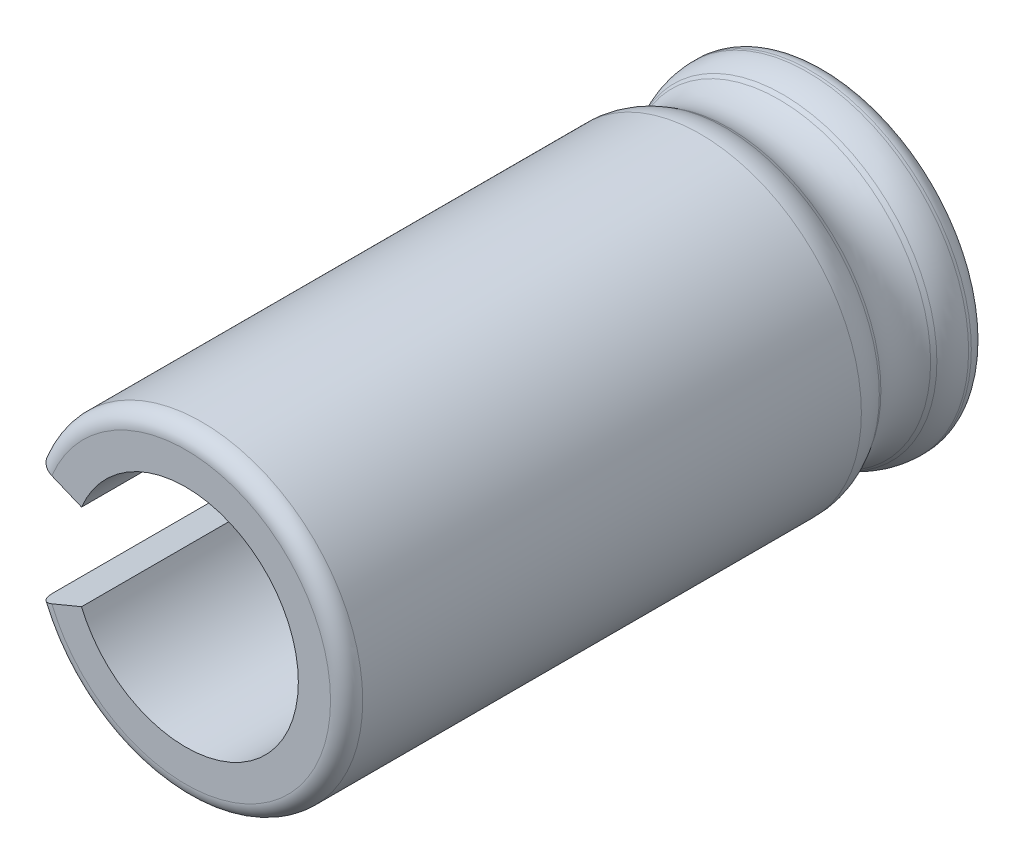
ISO-10303-21;
HEADER;
FILE_DESCRIPTION(('STEP AP214'),'2;1');
FILE_NAME('part.step','',(''),(''),'','','');
FILE_SCHEMA(('AUTOMOTIVE_DESIGN { 1 0 10303 214 1 1 1 1 }'));
ENDSEC;
DATA;
#1=APPLICATION_CONTEXT('core data for automotive mechanical design processes');
#2=APPLICATION_PROTOCOL_DEFINITION('international standard','automotive_design',2000,#1);
#3=PRODUCT_CONTEXT('',#1,'mechanical');
#4=PRODUCT('Part','Part','',(#3));
#5=PRODUCT_RELATED_PRODUCT_CATEGORY('part','',(#4));
#6=PRODUCT_DEFINITION_FORMATION('','',#4);
#7=PRODUCT_DEFINITION_CONTEXT('part definition',#1,'design');
#8=PRODUCT_DEFINITION('design','',#6,#7);
#9=PRODUCT_DEFINITION_SHAPE('','',#8);
#10=(LENGTH_UNIT() NAMED_UNIT(*) SI_UNIT(.MILLI.,.METRE.));
#11=(NAMED_UNIT(*) PLANE_ANGLE_UNIT() SI_UNIT($,.RADIAN.));
#12=(NAMED_UNIT(*) SI_UNIT($,.STERADIAN.) SOLID_ANGLE_UNIT());
#13=UNCERTAINTY_MEASURE_WITH_UNIT(LENGTH_MEASURE(1.E-05),#10,'distance_accuracy_value','');
#14=(GEOMETRIC_REPRESENTATION_CONTEXT(3) GLOBAL_UNCERTAINTY_ASSIGNED_CONTEXT((#13)) GLOBAL_UNIT_ASSIGNED_CONTEXT((#10,
#11,#12)) REPRESENTATION_CONTEXT('',''));
#15=CARTESIAN_POINT('',(0.,0.,0.));
#16=DIRECTION('',(0.,0.,1.));
#17=DIRECTION('',(1.,0.,0.));
#18=AXIS2_PLACEMENT_3D('',#15,#16,#17);
#19=CARTESIAN_POINT('',(0.,0.,0.66));
#20=DIRECTION('',(0.,0.,1.));
#21=DIRECTION('',(1.,0.,0.));
#22=AXIS2_PLACEMENT_3D('',#19,#20,#21);
#23=CYLINDRICAL_SURFACE('',#22,8.25);
#24=DIRECTION('',(0.,0.,1.));
#25=VECTOR('',#24,1.);
#26=CARTESIAN_POINT('',(-7.62200614321812,-3.15713831701198,0.66));
#27=LINE('',#26,#25);
#28=CARTESIAN_POINT('',(-7.62200614321812,-3.15713831701198,1.62446468675263));
#29=VERTEX_POINT('',#28);
#30=CARTESIAN_POINT('',(-7.62200614321812,-3.15713831701198,1.485));
#31=VERTEX_POINT('',#30);
#32=EDGE_CURVE('E102',#29,#31,#27,.F.);
#33=ORIENTED_EDGE('',*,*,#32,.T.);
#34=CARTESIAN_POINT('',(0.,0.,1.485));
#35=DIRECTION('',(0.,0.,1.));
#36=DIRECTION('',(1.,0.,0.));
#37=AXIS2_PLACEMENT_3D('',#34,#35,#36);
#38=CIRCLE('',#37,8.25);
#39=CARTESIAN_POINT('',(-7.62200614321812,3.15713831701198,1.485));
#40=VERTEX_POINT('',#39);
#41=EDGE_CURVE('E118',#40,#31,#38,.F.);
#42=ORIENTED_EDGE('',*,*,#41,.F.);
#43=DIRECTION('',(0.,0.,1.));
#44=VECTOR('',#43,1.);
#45=CARTESIAN_POINT('',(-7.62200614321812,3.15713831701198,0.66));
#46=LINE('',#45,#44);
#47=CARTESIAN_POINT('',(-7.62200614321812,3.15713831701198,1.62446468675263));
#48=VERTEX_POINT('',#47);
#49=EDGE_CURVE('E108',#40,#48,#46,.T.);
#50=ORIENTED_EDGE('',*,*,#49,.T.);
#51=CARTESIAN_POINT('',(0.,0.,1.62446468675263));
#52=DIRECTION('',(0.,0.,-1.));
#53=DIRECTION('',(1.,0.,0.));
#54=AXIS2_PLACEMENT_3D('',#51,#52,#53);
#55=CIRCLE('',#54,8.25);
#56=EDGE_CURVE('E159',#29,#48,#55,.F.);
#57=ORIENTED_EDGE('',*,*,#56,.F.);
#58=EDGE_LOOP('',(#33,#42,#50,#57));
#59=FACE_BOUND('',#58,.T.);
#60=ADVANCED_FACE('F17',(#59),#23,.T.);
#61=CARTESIAN_POINT('',(0.,0.,1.485));
#62=DIRECTION('',(0.,0.,1.));
#63=DIRECTION('',(1.,0.,0.));
#64=AXIS2_PLACEMENT_3D('',#61,#62,#63);
#65=TOROIDAL_SURFACE('',#64,7.425,0.825);
#66=CARTESIAN_POINT('',(-7.62200614321812,-3.15713831701198,1.485));
#67=CARTESIAN_POINT('',(-7.62204256182288,-3.15715340209199,1.4385869007782));
#68=CARTESIAN_POINT('',(-7.61838977789418,-3.15564036944831,1.39218557898556));
#69=CARTESIAN_POINT('',(-7.60397454988172,-3.14966938650084,1.30073102324611));
#70=CARTESIAN_POINT('',(-7.59321768404102,-3.145213746781,1.25567676055645));
#71=CARTESIAN_POINT('',(-7.5648554521704,-3.13346572568102,1.1681429880569));
#72=CARTESIAN_POINT('',(-7.54724679770689,-3.12617198218709,1.12566472589937));
#73=CARTESIAN_POINT('',(-7.50569620354201,-3.10896116255934,1.04451771986299));
#74=CARTESIAN_POINT('',(-7.4817553795292,-3.09904454855885,1.00584830653449));
#75=CARTESIAN_POINT('',(-7.42821320353762,-3.07686665310416,0.933405071623153));
#76=CARTESIAN_POINT('',(-7.39861130772004,-3.06460514638457,0.899631720935907));
#77=CARTESIAN_POINT('',(-7.33458880166737,-3.03808615608044,0.837943980824093));
#78=CARTESIAN_POINT('',(-7.30016826911911,-3.02382870467484,0.810029496960073));
#79=CARTESIAN_POINT('',(-7.22747906633709,-2.99371985104444,0.760844503551425));
#80=CARTESIAN_POINT('',(-7.18920923901439,-2.97786796953771,0.739575999710074));
#81=CARTESIAN_POINT('',(-7.10992142407507,-2.94502588125891,0.704306217909734));
#82=CARTESIAN_POINT('',(-7.06890506199236,-2.92803634780505,0.69030068355104));
#83=CARTESIAN_POINT('',(-6.99966567094381,-2.89935645298228,0.673435012043788));
#84=CARTESIAN_POINT('',(-6.97187820912626,-2.88784650943353,0.668399926773944));
#85=CARTESIAN_POINT('',(-6.91599955724884,-2.86470081397878,0.66168286404564));
#86=CARTESIAN_POINT('',(-6.88790885478471,-2.85306526404155,0.659996132962406));
#87=CARTESIAN_POINT('',(-6.85980552889632,-2.84142448531079,0.66));
#88=B_SPLINE_CURVE_WITH_KNOTS('',3,(#66,#67,#68,#69,#70,#71,#72,#73,#74,#75,#76,#77,#78,#79,#80,
#81,#82,#83,#84,#85,#86,#87),.UNSPECIFIED.,.F.,.F.,(4,2,2,2,2,2,2,2,2,2,4),(0.,
0.139054322565421,0.277999586981286,0.417011618920025,0.555999174107767,0.695000088043242,
0.833998761241885,0.973039342697627,1.11199834829052,1.20331120693813,1.29449433666177),.UNSPECIFIED.);
#89=CARTESIAN_POINT('',(-6.85980552889631,-2.84142448531078,0.66));
#90=VERTEX_POINT('',#89);
#91=EDGE_CURVE('E121',#31,#90,#88,.T.);
#92=ORIENTED_EDGE('',*,*,#91,.T.);
#93=CARTESIAN_POINT('',(0.,0.,0.66));
#94=DIRECTION('',(0.,0.,1.));
#95=DIRECTION('',(-0.923879532511287,-0.382683432365088,0.));
#96=AXIS2_PLACEMENT_3D('',#93,#94,#95);
#97=CIRCLE('',#96,7.425);
#98=CARTESIAN_POINT('',(-6.85980552889631,2.84142448531078,0.66));
#99=VERTEX_POINT('',#98);
#100=EDGE_CURVE('E125',#90,#99,#97,.T.);
#101=ORIENTED_EDGE('',*,*,#100,.T.);
#102=CARTESIAN_POINT('',(-6.85980552889631,2.84142448531078,0.66));
#103=CARTESIAN_POINT('',(-6.90268564130775,2.85918600942769,0.659960580786261));
#104=CARTESIAN_POINT('',(-6.94555487279344,2.87694302651757,0.663914325620036));
#105=CARTESIAN_POINT('',(-7.03004786499603,2.91194116981336,0.67951725598617));
#106=CARTESIAN_POINT('',(-7.07167257614739,2.92918268970212,0.691160403671727));
#107=CARTESIAN_POINT('',(-7.15254323696322,2.96268041421011,0.72185946223138));
#108=CARTESIAN_POINT('',(-7.19178803394722,2.97893614137346,0.740918932480317));
#109=CARTESIAN_POINT('',(-7.26675809194879,3.00998975616961,0.785892971521898));
#110=CARTESIAN_POINT('',(-7.30248397145722,3.02478789998971,0.811806332701936));
#111=CARTESIAN_POINT('',(-7.36941279346071,3.05251072577721,0.86975996638191));
#112=CARTESIAN_POINT('',(-7.40061530090498,3.06543522754067,0.901800827528727));
#113=CARTESIAN_POINT('',(-7.45760734140116,3.08904210366151,0.971098288723308));
#114=CARTESIAN_POINT('',(-7.48339696170375,3.09972451415929,1.00835480468346));
#115=CARTESIAN_POINT('',(-7.5288379704207,3.11854679625776,1.08703303082019));
#116=CARTESIAN_POINT('',(-7.54848750580686,3.12668590030905,1.12845599342081));
#117=CARTESIAN_POINT('',(-7.58107253532833,3.14018306146717,1.21427650588936));
#118=CARTESIAN_POINT('',(-7.59401196186422,3.14554274742766,1.25867229629206));
#119=CARTESIAN_POINT('',(-7.60959381057183,3.15199696048919,1.333616473116));
#120=CARTESIAN_POINT('',(-7.61424562279708,3.15392380420251,1.36369340505324));
#121=CARTESIAN_POINT('',(-7.62045137957036,3.15649431282279,1.42417602200821));
#122=CARTESIAN_POINT('',(-7.62200971589501,3.1571397968632,1.45458117925612));
#123=CARTESIAN_POINT('',(-7.62200614321812,3.15713831701198,1.48499999999999));
#124=B_SPLINE_CURVE_WITH_KNOTS('',3,(#102,#103,#104,#105,#106,#107,#108,#109,#110,#111,#112,
#113,#114,#115,#116,#117,#118,#119,#120,#121,#122,#123),.UNSPECIFIED.,.F.,.F.,(4,2,2,2,2,2,2,2,
2,2,4),(0.,0.139054322565421,0.277999586981286,0.417011618920024,0.555999174107765,
0.695000088043241,0.833998761241884,0.973039342697627,1.11199834829052,1.20331120693813,
1.29449433666177),.UNSPECIFIED.);
#125=EDGE_CURVE('E111',#99,#40,#124,.T.);
#126=ORIENTED_EDGE('',*,*,#125,.T.);
#127=ORIENTED_EDGE('',*,*,#41,.T.);
#128=EDGE_LOOP('',(#92,#101,#126,#127));
#129=FACE_BOUND('',#128,.T.);
#130=ADVANCED_FACE('F123',(#129),#65,.T.);
#131=CARTESIAN_POINT('',(0.,0.,1.62446468675263));
#132=DIRECTION('',(0.,0.,-1.));
#133=DIRECTION('',(1.,0.,0.));
#134=AXIS2_PLACEMENT_3D('',#131,#132,#133);
#135=TOROIDAL_SURFACE('',#134,5.775,2.475);
#136=CARTESIAN_POINT('',(-7.29614920451681,-3.02216395360852,2.89784168143576));
#137=CARTESIAN_POINT('',(-7.32959862613637,-3.03601915769687,2.83751440338843));
#138=CARTESIAN_POINT('',(-7.36065887081203,-3.04888473229216,2.7756364129829));
#139=CARTESIAN_POINT('',(-7.417810131177,-3.07255755944205,2.64922920039002));
#140=CARTESIAN_POINT('',(-7.44389994826096,-3.08336431551806,2.58469934326148));
#141=CARTESIAN_POINT('',(-7.49038153195387,-3.10261761788424,2.45492450615544));
#142=CARTESIAN_POINT('',(-7.51088691933286,-3.11111122743833,2.38972719072762));
#143=CARTESIAN_POINT('',(-7.5468028239492,-3.12598808223532,2.25773743006298));
#144=CARTESIAN_POINT('',(-7.56221518008407,-3.1323720891745,2.19094556991512));
#145=CARTESIAN_POINT('',(-7.59052595214416,-3.14409879492304,2.04209633392546));
#146=CARTESIAN_POINT('',(-7.60222399703514,-3.14894428377014,1.9597684469408));
#147=CARTESIAN_POINT('',(-7.61802539438933,-3.15548943685869,1.79312126799482));
#148=CARTESIAN_POINT('',(-7.62202236655024,-3.15714503693617,1.7087901505208));
#149=CARTESIAN_POINT('',(-7.62200614321812,-3.15713831701198,1.62446468675264));
#150=B_SPLINE_CURVE_WITH_KNOTS('',3,(#136,#137,#138,#139,#140,#141,#142,#143,#144,#145,#146,
#147,#148,#149),.UNSPECIFIED.,.F.,.F.,(4,2,2,2,2,2,4),(0.,0.211008075584621,0.422066970973275,
0.628441188520761,0.834740810658238,1.08419689867841,1.33707486560758),.UNSPECIFIED.);
#151=CARTESIAN_POINT('',(-7.29614920451681,-3.02216395360852,2.89784168143576));
#152=VERTEX_POINT('',#151);
#153=EDGE_CURVE('E166',#152,#29,#150,.T.);
#154=ORIENTED_EDGE('',*,*,#153,.T.);
#155=ORIENTED_EDGE('',*,*,#56,.T.);
#156=CARTESIAN_POINT('',(-7.62200614321812,3.15713831701198,1.62446468675263));
#157=CARTESIAN_POINT('',(-7.622013293985,3.1571412789566,1.69482242196139));
#158=CARTESIAN_POINT('',(-7.61923463906558,3.15599032240382,1.765179382395));
#159=CARTESIAN_POINT('',(-7.60815603495956,3.15140141433095,1.90539942074843));
#160=CARTESIAN_POINT('',(-7.59985475616942,3.14796291207103,1.97526237563904));
#161=CARTESIAN_POINT('',(-7.57802623977233,3.13892124453288,2.11242833256909));
#162=CARTESIAN_POINT('',(-7.56461908766232,3.13336782029611,2.17975373643241));
#163=CARTESIAN_POINT('',(-7.5326777519397,3.12013728583949,2.3129350938501));
#164=CARTESIAN_POINT('',(-7.51414542328028,3.1124609439664,2.37879156975146));
#165=CARTESIAN_POINT('',(-7.46766889041409,3.09320973372115,2.52219461467689));
#166=CARTESIAN_POINT('',(-7.43856679390817,3.0811552506549,2.59930467503715));
#167=CARTESIAN_POINT('',(-7.37290362716102,3.05395667643987,2.75100303208612));
#168=CARTESIAN_POINT('',(-7.33624571551737,3.03877247226879,2.82554222734678));
#169=CARTESIAN_POINT('',(-7.29614920451682,3.02216395360852,2.89784168143575));
#170=B_SPLINE_CURVE_WITH_KNOTS('',3,(#156,#157,#158,#159,#160,#161,#162,#163,#164,#165,#166,
#167,#168,#169),.UNSPECIFIED.,.F.,.F.,(4,2,2,2,2,2,4),(0.,0.211008075584621,0.422066970973275,
0.628441188520762,0.834740810658239,1.08419689867841,1.33707486560757),.UNSPECIFIED.);
#171=CARTESIAN_POINT('',(-7.29614920451681,3.02216395360852,2.89784168143576));
#172=VERTEX_POINT('',#171);
#173=EDGE_CURVE('E114',#48,#172,#170,.T.);
#174=ORIENTED_EDGE('',*,*,#173,.T.);
#175=CARTESIAN_POINT('',(0.,0.,2.89784168143576));
#176=DIRECTION('',(0.,0.,-1.));
#177=DIRECTION('',(-1.,0.,0.));
#178=AXIS2_PLACEMENT_3D('',#175,#176,#177);
#179=CIRCLE('',#178,7.89729499113855);
#180=EDGE_CURVE('E155',#152,#172,#179,.F.);
#181=ORIENTED_EDGE('',*,*,#180,.F.);
#182=EDGE_LOOP('',(#154,#155,#174,#181));
#183=FACE_BOUND('',#182,.T.);
#184=ADVANCED_FACE('F146',(#183),#135,.T.);
#185=CARTESIAN_POINT('',(0.,0.,0.66));
#186=DIRECTION('',(0.,0.,1.));
#187=DIRECTION('',(1.,0.,0.));
#188=AXIS2_PLACEMENT_3D('',#185,#186,#187);
#189=PLANE('',#188);
#190=ORIENTED_EDGE('',*,*,#100,.F.);
#191=DIRECTION('',(-0.923879532511287,-0.382683432365089,0.));
#192=VECTOR('',#191,1.);
#193=CARTESIAN_POINT('',(-5.33540430025268,-2.20999682190838,0.66));
#194=LINE('',#193,#192);
#195=CARTESIAN_POINT('',(-5.33540430025268,-2.20999682190838,0.66));
#196=VERTEX_POINT('',#195);
#197=EDGE_CURVE('E165',#196,#90,#194,.T.);
#198=ORIENTED_EDGE('',*,*,#197,.F.);
#199=CARTESIAN_POINT('',(0.,0.,0.66));
#200=DIRECTION('',(0.,0.,1.));
#201=DIRECTION('',(1.,0.,0.));
#202=AXIS2_PLACEMENT_3D('',#199,#200,#201);
#203=CIRCLE('',#202,5.775);
#204=CARTESIAN_POINT('',(-5.33540430025269,2.20999682190838,0.66));
#205=VERTEX_POINT('',#204);
#206=EDGE_CURVE('E287',#196,#205,#203,.T.);
#207=ORIENTED_EDGE('',*,*,#206,.T.);
#208=DIRECTION('',(0.923879532511286,-0.382683432365091,0.));
#209=VECTOR('',#208,1.);
#210=CARTESIAN_POINT('',(-6.85980552889631,2.84142448531078,0.66));
#211=LINE('',#210,#209);
#212=EDGE_CURVE('E241',#99,#205,#211,.T.);
#213=ORIENTED_EDGE('',*,*,#212,.F.);
#214=EDGE_LOOP('',(#190,#198,#207,#213));
#215=FACE_BOUND('',#214,.T.);
#216=ADVANCED_FACE('F250',(#215),#189,.F.);
#217=CARTESIAN_POINT('',(0.,0.,2.89784168143576));
#218=DIRECTION('',(0.,0.,-1.));
#219=DIRECTION('',(-1.,0.,0.));
#220=AXIS2_PLACEMENT_3D('',#217,#218,#219);
#221=CONICAL_SURFACE('',#220,7.89729499113855,0.540419500270588);
#222=DIRECTION('',(0.475332098003425,0.196889001624275,0.857492925712544));
#223=VECTOR('',#222,1.);
#224=CARTESIAN_POINT('',(-7.62200614321812,-3.15713831701198,2.31));
#225=LINE('',#224,#223);
#226=CARTESIAN_POINT('',(-7.18457338727049,-2.97594773687223,3.09912300531687));
#227=VERTEX_POINT('',#226);
#228=EDGE_CURVE('E240',#227,#152,#225,.F.);
#229=ORIENTED_EDGE('',*,*,#228,.T.);
#230=ORIENTED_EDGE('',*,*,#180,.T.);
#231=DIRECTION('',(0.475332098003425,-0.196889001624275,0.857492925712544));
#232=VECTOR('',#231,1.);
#233=CARTESIAN_POINT('',(-7.62200614321812,3.15713831701198,2.31));
#234=LINE('',#233,#232);
#235=CARTESIAN_POINT('',(-7.18457338727049,2.97594773687223,3.09912300531687));
#236=VERTEX_POINT('',#235);
#237=EDGE_CURVE('E238',#172,#236,#234,.T.);
#238=ORIENTED_EDGE('',*,*,#237,.T.);
#239=CARTESIAN_POINT('',(0.,0.,3.09912300531687));
#240=DIRECTION('',(0.,0.,-1.));
#241=DIRECTION('',(1.,0.,0.));
#242=AXIS2_PLACEMENT_3D('',#239,#240,#241);
#243=CIRCLE('',#242,7.77652619680988);
#244=EDGE_CURVE('E307',#236,#227,#243,.T.);
#245=ORIENTED_EDGE('',*,*,#244,.T.);
#246=EDGE_LOOP('',(#229,#230,#238,#245));
#247=FACE_BOUND('',#246,.T.);
#248=ADVANCED_FACE('F259',(#247),#221,.T.);
#249=CARTESIAN_POINT('',(0.,0.,33.5));
#250=DIRECTION('',(0.,0.,1.));
#251=DIRECTION('',(1.,0.,0.));
#252=AXIS2_PLACEMENT_3D('',#249,#250,#251);
#253=PLANE('',#252);
#254=DIRECTION('',(-0.923879532511287,-0.382683432365089,0.));
#255=VECTOR('',#254,1.);
#256=CARTESIAN_POINT('',(-5.33540430025268,-2.20999682190838,33.5));
#257=LINE('',#256,#255);
#258=CARTESIAN_POINT('',(-5.33540430025268,-2.20999682190838,33.5));
#259=VERTEX_POINT('',#258);
#260=CARTESIAN_POINT('',(-6.85980552889631,-2.84142448531078,33.5));
#261=VERTEX_POINT('',#260);
#262=EDGE_CURVE('E277',#259,#261,#257,.T.);
#263=ORIENTED_EDGE('',*,*,#262,.T.);
#264=CARTESIAN_POINT('',(0.,0.,33.5));
#265=DIRECTION('',(0.,0.,-1.));
#266=DIRECTION('',(-0.923879532511288,0.382683432365088,0.));
#267=AXIS2_PLACEMENT_3D('',#264,#265,#266);
#268=CIRCLE('',#267,7.425);
#269=CARTESIAN_POINT('',(-6.85980552889631,2.84142448531078,33.5));
#270=VERTEX_POINT('',#269);
#271=EDGE_CURVE('E346',#270,#261,#268,.T.);
#272=ORIENTED_EDGE('',*,*,#271,.F.);
#273=DIRECTION('',(-0.923879532511287,0.382683432365088,0.));
#274=VECTOR('',#273,1.);
#275=CARTESIAN_POINT('',(-14.5,6.00609665440985,33.5));
#276=LINE('',#275,#274);
#277=CARTESIAN_POINT('',(-5.33540430025269,2.20999682190839,33.5));
#278=VERTEX_POINT('',#277);
#279=EDGE_CURVE('E237',#270,#278,#276,.F.);
#280=ORIENTED_EDGE('',*,*,#279,.T.);
#281=CARTESIAN_POINT('',(0.,0.,33.5));
#282=DIRECTION('',(0.,0.,1.));
#283=DIRECTION('',(1.,0.,0.));
#284=AXIS2_PLACEMENT_3D('',#281,#282,#283);
#285=CIRCLE('',#284,5.775);
#286=EDGE_CURVE('E284',#278,#259,#285,.F.);
#287=ORIENTED_EDGE('',*,*,#286,.T.);
#288=EDGE_LOOP('',(#263,#272,#280,#287));
#289=FACE_BOUND('',#288,.T.);
#290=ADVANCED_FACE('F262',(#289),#253,.T.);
#291=CARTESIAN_POINT('',(0.,0.,-6.78604721240346));
#292=DIRECTION('',(0.,0.,1.));
#293=DIRECTION('',(1.,0.,0.));
#294=AXIS2_PLACEMENT_3D('',#291,#292,#293);
#295=CYLINDRICAL_SURFACE('',#294,5.775);
#296=ORIENTED_EDGE('',*,*,#206,.F.);
#297=DIRECTION('',(0.,0.,1.));
#298=VECTOR('',#297,1.);
#299=CARTESIAN_POINT('',(-5.33540430025268,-2.20999682190838,-55.5606309650177));
#300=LINE('',#299,#298);
#301=EDGE_CURVE('E352',#196,#259,#300,.T.);
#302=ORIENTED_EDGE('',*,*,#301,.T.);
#303=ORIENTED_EDGE('',*,*,#286,.F.);
#304=DIRECTION('',(0.,0.,1.));
#305=VECTOR('',#304,1.);
#306=CARTESIAN_POINT('',(-5.33540430025269,2.20999682190839,-55.5606309650177));
#307=LINE('',#306,#305);
#308=EDGE_CURVE('E228',#278,#205,#307,.F.);
#309=ORIENTED_EDGE('',*,*,#308,.T.);
#310=EDGE_LOOP('',(#296,#302,#303,#309));
#311=FACE_BOUND('',#310,.T.);
#312=ADVANCED_FACE('F267',(#311),#295,.F.);
#313=CARTESIAN_POINT('',(0.,0.,4.3725));
#314=DIRECTION('',(0.,0.,-1.));
#315=DIRECTION('',(1.,0.,0.));
#316=AXIS2_PLACEMENT_3D('',#313,#314,#315);
#317=TOROIDAL_SURFACE('',#316,9.89882118794842,2.475);
#318=CARTESIAN_POINT('',(0.,0.,5.64587699468313));
#319=DIRECTION('',(0.,0.,1.));
#320=DIRECTION('',(-1.,0.,0.));
#321=AXIS2_PLACEMENT_3D('',#318,#319,#320);
#322=CIRCLE('',#321,7.77652619680988);
#323=CARTESIAN_POINT('',(-7.18457338727049,-2.97594773687223,5.64587699468313));
#324=VERTEX_POINT('',#323);
#325=CARTESIAN_POINT('',(-7.18457338727049,2.97594773687223,5.64587699468313));
#326=VERTEX_POINT('',#325);
#327=EDGE_CURVE('E314',#324,#326,#322,.T.);
#328=ORIENTED_EDGE('',*,*,#327,.F.);
#329=CARTESIAN_POINT('',(-7.18457338727049,-2.97594773687223,5.64587699468313));
#330=CARTESIAN_POINT('',(-7.15147343920666,-2.96223728947035,5.58617812398875));
#331=CARTESIAN_POINT('',(-7.12071302558303,-2.94949590896323,5.52496353789929));
#332=CARTESIAN_POINT('',(-7.06406412718097,-2.92603116695161,5.39995132223573));
#333=CARTESIAN_POINT('',(-7.03817541675925,-2.91530771198258,5.33615381246163));
#334=CARTESIAN_POINT('',(-6.99148465664247,-2.8959677659047,5.20648787945577));
#335=CARTESIAN_POINT('',(-6.9706771978609,-2.88734903427886,5.14062174338803));
#336=CARTESIAN_POINT('',(-6.93425953555619,-2.87226434464232,5.00724740075713));
#337=CARTESIAN_POINT('',(-6.91864925369947,-2.8657983541848,4.93973921895988));
#338=CARTESIAN_POINT('',(-6.87979191431389,-2.84970311721356,4.73540170021029));
#339=CARTESIAN_POINT('',(-6.86449447100579,-2.84336670872571,4.59669286092358));
#340=CARTESIAN_POINT('',(-6.8556417882219,-2.83969980745324,4.31848300908768));
#341=CARTESIAN_POINT('',(-6.86209418124128,-2.84237247615163,4.17898173560358));
#342=CARTESIAN_POINT('',(-6.89654328512691,-2.85664176219265,3.90303561409497));
#343=CARTESIAN_POINT('',(-6.92455609825241,-2.86824504930946,3.76659312892113));
#344=CARTESIAN_POINT('',(-7.0013525968782,-2.90005520058303,3.50089490335448));
#345=CARTESIAN_POINT('',(-7.05009787310478,-2.9202461550977,3.37162637054209));
#346=CARTESIAN_POINT('',(-7.12031883965201,-2.94933263180451,3.22260544472921));
#347=CARTESIAN_POINT('',(-7.13262965395598,-2.95443193805307,3.19755742496548));
#348=CARTESIAN_POINT('',(-7.15802275219002,-2.96495010373228,3.14796715144671));
#349=CARTESIAN_POINT('',(-7.17110399215063,-2.97036853073662,3.12342427143973));
#350=CARTESIAN_POINT('',(-7.18457338727049,-2.97594773687223,3.09912300531687));
#351=B_SPLINE_CURVE_WITH_KNOTS('',3,(#329,#330,#331,#332,#333,#334,#335,#336,#337,#338,#339,
#340,#341,#342,#343,#344,#345,#346,#347,#348,#349,#350),.UNSPECIFIED.,.F.,.F.,(4,2,2,2,2,2,2,2,
2,2,4),(0.,0.208804889739494,0.417600105854582,0.626172077106107,0.834740904549245,
1.25166712330725,1.66873966586005,2.08612399893733,2.50273842472258,2.5878463339814,
2.6728414584263),.UNSPECIFIED.);
#352=EDGE_CURVE('E193',#324,#227,#351,.T.);
#353=ORIENTED_EDGE('',*,*,#352,.T.);
#354=ORIENTED_EDGE('',*,*,#244,.F.);
#355=CARTESIAN_POINT('',(-7.18457338727049,2.97594773687223,3.09912300531687));
#356=CARTESIAN_POINT('',(-7.15147343920666,2.96223728947035,3.15882187601125));
#357=CARTESIAN_POINT('',(-7.12071302558303,2.94949590896323,3.22003646210071));
#358=CARTESIAN_POINT('',(-7.06406412718097,2.92603116695161,3.34504867776426));
#359=CARTESIAN_POINT('',(-7.03817541675925,2.91530771198258,3.40884618753837));
#360=CARTESIAN_POINT('',(-6.99148465664247,2.8959677659047,3.53851212054423));
#361=CARTESIAN_POINT('',(-6.9706771978609,2.88734903427886,3.60437825661197));
#362=CARTESIAN_POINT('',(-6.93425953555619,2.87226434464232,3.73775259924287));
#363=CARTESIAN_POINT('',(-6.91864925369947,2.8657983541848,3.80526078104012));
#364=CARTESIAN_POINT('',(-6.87979191431389,2.84970311721356,4.00959829978971));
#365=CARTESIAN_POINT('',(-6.86449447100579,2.84336670872571,4.14830713907642));
#366=CARTESIAN_POINT('',(-6.8556417882219,2.83969980745324,4.42651699091232));
#367=CARTESIAN_POINT('',(-6.86209418124128,2.84237247615163,4.56601826439642));
#368=CARTESIAN_POINT('',(-6.89654328512691,2.85664176219265,4.84196438590503));
#369=CARTESIAN_POINT('',(-6.92455609825241,2.86824504930946,4.97840687107887));
#370=CARTESIAN_POINT('',(-7.0013525968782,2.90005520058303,5.24410509664551));
#371=CARTESIAN_POINT('',(-7.05009787310478,2.9202461550977,5.37337362945791));
#372=CARTESIAN_POINT('',(-7.12031883965201,2.94933263180451,5.52239455527079));
#373=CARTESIAN_POINT('',(-7.13262965395598,2.95443193805307,5.54744257503452));
#374=CARTESIAN_POINT('',(-7.15802275219002,2.96495010373228,5.59703284855329));
#375=CARTESIAN_POINT('',(-7.17110399215063,2.97036853073662,5.62157572856027));
#376=CARTESIAN_POINT('',(-7.18457338727049,2.97594773687223,5.64587699468313));
#377=B_SPLINE_CURVE_WITH_KNOTS('',3,(#355,#356,#357,#358,#359,#360,#361,#362,#363,#364,#365,
#366,#367,#368,#369,#370,#371,#372,#373,#374,#375,#376),.UNSPECIFIED.,.F.,.F.,(4,2,2,2,2,2,2,2,
2,2,4),(0.,0.208804889739493,0.417600105854581,0.626172077106105,0.834740904549245,
1.25166712330725,1.66873966586004,2.08612399893733,2.50273842472258,2.5878463339814,
2.67284145842631),.UNSPECIFIED.);
#378=EDGE_CURVE('E308',#236,#326,#377,.T.);
#379=ORIENTED_EDGE('',*,*,#378,.T.);
#380=EDGE_LOOP('',(#328,#353,#354,#379));
#381=FACE_BOUND('',#380,.T.);
#382=ADVANCED_FACE('F320',(#381),#317,.F.);
#383=CARTESIAN_POINT('',(0.,0.,5.84715831856425));
#384=DIRECTION('',(0.,0.,1.));
#385=DIRECTION('',(1.,0.,0.));
#386=AXIS2_PLACEMENT_3D('',#383,#384,#385);
#387=CONICAL_SURFACE('',#386,7.89729499113855,0.540419500270582);
#388=DIRECTION('',(0.47533209800341,0.196889001624268,-0.857492925712554));
#389=VECTOR('',#388,1.);
#390=CARTESIAN_POINT('',(-7.29614920451681,-3.02216395360852,5.84715831856425));
#391=LINE('',#390,#389);
#392=CARTESIAN_POINT('',(-7.29614920451681,-3.02216395360852,5.84715831856425));
#393=VERTEX_POINT('',#392);
#394=EDGE_CURVE('E190',#393,#324,#391,.T.);
#395=ORIENTED_EDGE('',*,*,#394,.T.);
#396=ORIENTED_EDGE('',*,*,#327,.T.);
#397=DIRECTION('',(-0.47533209800341,0.196889001624268,0.857492925712554));
#398=VECTOR('',#397,1.);
#399=CARTESIAN_POINT('',(-7.18457338727049,2.97594773687223,5.64587699468313));
#400=LINE('',#399,#398);
#401=CARTESIAN_POINT('',(-7.29614920451681,3.02216395360852,5.84715831856425));
#402=VERTEX_POINT('',#401);
#403=EDGE_CURVE('E313',#326,#402,#400,.T.);
#404=ORIENTED_EDGE('',*,*,#403,.T.);
#405=CARTESIAN_POINT('',(0.,0.,5.84715831856425));
#406=DIRECTION('',(0.,0.,1.));
#407=DIRECTION('',(1.,0.,0.));
#408=AXIS2_PLACEMENT_3D('',#405,#406,#407);
#409=CIRCLE('',#408,7.89729499113855);
#410=EDGE_CURVE('E173',#393,#402,#409,.T.);
#411=ORIENTED_EDGE('',*,*,#410,.F.);
#412=EDGE_LOOP('',(#395,#396,#404,#411));
#413=FACE_BOUND('',#412,.T.);
#414=ADVANCED_FACE('F324',(#413),#387,.T.);
#415=CARTESIAN_POINT('',(-14.5,6.00609665440985,-55.5606309650177));
#416=DIRECTION('',(0.382683432365088,0.923879532511287,0.));
#417=DIRECTION('',(-0.923879532511287,0.382683432365088,0.));
#418=AXIS2_PLACEMENT_3D('',#415,#416,#417);
#419=PLANE('',#418);
#420=ORIENTED_EDGE('',*,*,#212,.T.);
#421=ORIENTED_EDGE('',*,*,#308,.F.);
#422=ORIENTED_EDGE('',*,*,#279,.F.);
#423=CARTESIAN_POINT('',(-7.62200614321812,3.15713831701198,32.675));
#424=CARTESIAN_POINT('',(-7.62204256182288,3.15715340209199,32.7214130992218));
#425=CARTESIAN_POINT('',(-7.61838977789419,3.15564036944831,32.7678144210144));
#426=CARTESIAN_POINT('',(-7.60397454988172,3.14966938650084,32.8592689767539));
#427=CARTESIAN_POINT('',(-7.59321768404102,3.145213746781,32.9043232394436));
#428=CARTESIAN_POINT('',(-7.56485545217039,3.13346572568101,32.9918570119431));
#429=CARTESIAN_POINT('',(-7.54724679770689,3.12617198218709,33.0343352741006));
#430=CARTESIAN_POINT('',(-7.50569620354201,3.10896116255934,33.115482280137));
#431=CARTESIAN_POINT('',(-7.4817553795292,3.09904454855885,33.1541516934655));
#432=CARTESIAN_POINT('',(-7.42821320353761,3.07686665310416,33.2265949283769));
#433=CARTESIAN_POINT('',(-7.39861130772004,3.06460514638457,33.2603682790641));
#434=CARTESIAN_POINT('',(-7.33458880166737,3.03808615608044,33.3220560191759));
#435=CARTESIAN_POINT('',(-7.30016826911911,3.02382870467484,33.3499705030399));
#436=CARTESIAN_POINT('',(-7.22747906633708,2.99371985104444,33.3991554964486));
#437=CARTESIAN_POINT('',(-7.18920923901439,2.9778679695377,33.4204240002899));
#438=CARTESIAN_POINT('',(-7.10992142407507,2.94502588125891,33.4556937820903));
#439=CARTESIAN_POINT('',(-7.06890506199235,2.92803634780504,33.469699316449));
#440=CARTESIAN_POINT('',(-6.99966567094381,2.89935645298228,33.4865649879562));
#441=CARTESIAN_POINT('',(-6.97187820912626,2.88784650943353,33.4916000732261));
#442=CARTESIAN_POINT('',(-6.91599955724884,2.86470081397878,33.4983171359544));
#443=CARTESIAN_POINT('',(-6.88790885478471,2.85306526404155,33.5000038670376));
#444=CARTESIAN_POINT('',(-6.85980552889632,2.84142448531079,33.5));
#445=B_SPLINE_CURVE_WITH_KNOTS('',3,(#423,#424,#425,#426,#427,#428,#429,#430,#431,#432,#433,
#434,#435,#436,#437,#438,#439,#440,#441,#442,#443,#444),.UNSPECIFIED.,.F.,.F.,(4,2,2,2,2,2,2,2,
2,2,4),(0.,0.139054322565421,0.277999586981287,0.417011618920024,0.55599917410776,
0.695000088043241,0.833998761241883,0.973039342697624,1.11199834829052,1.20331120693812,
1.29449433666176),.UNSPECIFIED.);
#446=CARTESIAN_POINT('',(-7.62200614321812,3.15713831701198,32.675));
#447=VERTEX_POINT('',#446);
#448=EDGE_CURVE('E236',#447,#270,#445,.T.);
#449=ORIENTED_EDGE('',*,*,#448,.F.);
#450=DIRECTION('',(0.,0.,1.));
#451=VECTOR('',#450,1.);
#452=CARTESIAN_POINT('',(-7.62200614321812,3.15713831701198,6.435));
#453=LINE('',#452,#451);
#454=CARTESIAN_POINT('',(-7.62200614321812,3.15713831701198,7.12053531324737));
#455=VERTEX_POINT('',#454);
#456=EDGE_CURVE('E198',#455,#447,#453,.T.);
#457=ORIENTED_EDGE('',*,*,#456,.F.);
#458=CARTESIAN_POINT('',(-7.29614920451681,3.02216395360852,5.84715831856425));
#459=CARTESIAN_POINT('',(-7.32959862613637,3.03601915769687,5.90748559661158));
#460=CARTESIAN_POINT('',(-7.36065887081203,3.04888473229216,5.96936358701711));
#461=CARTESIAN_POINT('',(-7.417810131177,3.07255755944205,6.09577079960999));
#462=CARTESIAN_POINT('',(-7.44389994826096,3.08336431551806,6.16030065673853));
#463=CARTESIAN_POINT('',(-7.49038153195387,3.10261761788424,6.29007549384457));
#464=CARTESIAN_POINT('',(-7.51088691933286,3.11111122743833,6.35527280927239));
#465=CARTESIAN_POINT('',(-7.5468028239492,3.12598808223532,6.48726256993703));
#466=CARTESIAN_POINT('',(-7.56221518008407,3.1323720891745,6.55405443008489));
#467=CARTESIAN_POINT('',(-7.59052595214416,3.14409879492304,6.70290366607455));
#468=CARTESIAN_POINT('',(-7.60222399703514,3.14894428377014,6.7852315530592));
#469=CARTESIAN_POINT('',(-7.61802539438933,3.15548943685869,6.95187873200518));
#470=CARTESIAN_POINT('',(-7.62202236655024,3.15714503693617,7.0362098494792));
#471=CARTESIAN_POINT('',(-7.62200614321812,3.15713831701198,7.12053531324736));
#472=B_SPLINE_CURVE_WITH_KNOTS('',3,(#458,#459,#460,#461,#462,#463,#464,#465,#466,#467,#468,
#469,#470,#471),.UNSPECIFIED.,.F.,.F.,(4,2,2,2,2,2,4),(0.,0.211008075584621,0.422066970973277,
0.628441188520763,0.834740810658239,1.08419689867841,1.33707486560756),.UNSPECIFIED.);
#473=EDGE_CURVE('E174',#402,#455,#472,.T.);
#474=ORIENTED_EDGE('',*,*,#473,.F.);
#475=ORIENTED_EDGE('',*,*,#403,.F.);
#476=ORIENTED_EDGE('',*,*,#378,.F.);
#477=ORIENTED_EDGE('',*,*,#237,.F.);
#478=ORIENTED_EDGE('',*,*,#173,.F.);
#479=ORIENTED_EDGE('',*,*,#49,.F.);
#480=ORIENTED_EDGE('',*,*,#125,.F.);
#481=EDGE_LOOP('',(#420,#421,#422,#449,#457,#474,#475,#476,#477,#478,#479,#480));
#482=FACE_BOUND('',#481,.T.);
#483=ADVANCED_FACE('F109',(#482),#419,.F.);
#484=CARTESIAN_POINT('',(0.,0.,32.675));
#485=DIRECTION('',(0.,0.,-1.));
#486=DIRECTION('',(1.,0.,0.));
#487=AXIS2_PLACEMENT_3D('',#484,#485,#486);
#488=TOROIDAL_SURFACE('',#487,7.425,0.825);
#489=CARTESIAN_POINT('',(-6.85980552889631,-2.84142448531078,33.5));
#490=CARTESIAN_POINT('',(-6.90268564130775,-2.85918600942769,33.5000394192137));
#491=CARTESIAN_POINT('',(-6.94555487279344,-2.87694302651757,33.49608567438));
#492=CARTESIAN_POINT('',(-7.03004786499603,-2.91194116981336,33.4804827440138));
#493=CARTESIAN_POINT('',(-7.07167257614739,-2.92918268970212,33.4688395963283));
#494=CARTESIAN_POINT('',(-7.15254323696322,-2.96268041421011,33.4381405377686));
#495=CARTESIAN_POINT('',(-7.19178803394722,-2.97893614137346,33.4190810675197));
#496=CARTESIAN_POINT('',(-7.26675809194879,-3.00998975616961,33.3741070284781));
#497=CARTESIAN_POINT('',(-7.30248397145722,-3.02478789998971,33.3481936672981));
#498=CARTESIAN_POINT('',(-7.36941279346071,-3.05251072577721,33.2902400336181));
#499=CARTESIAN_POINT('',(-7.40061530090498,-3.06543522754067,33.2581991724713));
#500=CARTESIAN_POINT('',(-7.45760734140116,-3.08904210366151,33.1889017112767));
#501=CARTESIAN_POINT('',(-7.48339696170375,-3.09972451415929,33.1516451953165));
#502=CARTESIAN_POINT('',(-7.5288379704207,-3.11854679625776,33.0729669691798));
#503=CARTESIAN_POINT('',(-7.54848750580686,-3.12668590030904,33.0315440065792));
#504=CARTESIAN_POINT('',(-7.58107253532833,-3.14018306146717,32.9457234941106));
#505=CARTESIAN_POINT('',(-7.59401196186421,-3.14554274742765,32.9013277037079));
#506=CARTESIAN_POINT('',(-7.60959381057182,-3.15199696048919,32.826383526884));
#507=CARTESIAN_POINT('',(-7.61424562279708,-3.15392380420251,32.7963065949468));
#508=CARTESIAN_POINT('',(-7.62045137957035,-3.15649431282279,32.7358239779918));
#509=CARTESIAN_POINT('',(-7.622009715895,-3.1571397968632,32.7054188207439));
#510=CARTESIAN_POINT('',(-7.62200614321812,-3.15713831701198,32.675));
#511=B_SPLINE_CURVE_WITH_KNOTS('',3,(#489,#490,#491,#492,#493,#494,#495,#496,#497,#498,#499,
#500,#501,#502,#503,#504,#505,#506,#507,#508,#509,#510),.UNSPECIFIED.,.F.,.F.,(4,2,2,2,2,2,2,2,
2,2,4),(0.,0.139054322565421,0.277999586981287,0.417011618920023,0.555999174107767,
0.695000088043241,0.833998761241883,0.973039342697623,1.11199834829052,1.20331120693812,
1.29449433666176),.UNSPECIFIED.);
#512=CARTESIAN_POINT('',(-7.62200614321812,-3.15713831701198,32.675));
#513=VERTEX_POINT('',#512);
#514=EDGE_CURVE('E194',#261,#513,#511,.T.);
#515=ORIENTED_EDGE('',*,*,#514,.T.);
#516=CARTESIAN_POINT('',(0.,0.,32.675));
#517=DIRECTION('',(0.,0.,1.));
#518=DIRECTION('',(1.,0.,0.));
#519=AXIS2_PLACEMENT_3D('',#516,#517,#518);
#520=CIRCLE('',#519,8.25);
#521=EDGE_CURVE('E195',#447,#513,#520,.F.);
#522=ORIENTED_EDGE('',*,*,#521,.F.);
#523=ORIENTED_EDGE('',*,*,#448,.T.);
#524=ORIENTED_EDGE('',*,*,#271,.T.);
#525=EDGE_LOOP('',(#515,#522,#523,#524));
#526=FACE_BOUND('',#525,.T.);
#527=ADVANCED_FACE('F204',(#526),#488,.T.);
#528=CARTESIAN_POINT('',(-14.5,-6.00609665440985,-55.5606309650177));
#529=DIRECTION('',(0.382683432365088,-0.923879532511287,0.));
#530=DIRECTION('',(0.923879532511287,0.382683432365088,0.));
#531=AXIS2_PLACEMENT_3D('',#528,#529,#530);
#532=PLANE('',#531);
#533=ORIENTED_EDGE('',*,*,#32,.F.);
#534=ORIENTED_EDGE('',*,*,#153,.F.);
#535=ORIENTED_EDGE('',*,*,#228,.F.);
#536=ORIENTED_EDGE('',*,*,#352,.F.);
#537=ORIENTED_EDGE('',*,*,#394,.F.);
#538=CARTESIAN_POINT('',(-7.62200614321812,-3.15713831701198,7.12053531324737));
#539=CARTESIAN_POINT('',(-7.622013293985,-3.1571412789566,7.05017757803861));
#540=CARTESIAN_POINT('',(-7.61923463906558,-3.15599032240382,6.97982061760499));
#541=CARTESIAN_POINT('',(-7.60815603495956,-3.15140141433095,6.83960057925157));
#542=CARTESIAN_POINT('',(-7.59985475616942,-3.14796291207103,6.76973762436096));
#543=CARTESIAN_POINT('',(-7.57802623977233,-3.13892124453287,6.63257166743091));
#544=CARTESIAN_POINT('',(-7.56461908766232,-3.13336782029611,6.56524626356759));
#545=CARTESIAN_POINT('',(-7.5326777519397,-3.12013728583949,6.4320649061499));
#546=CARTESIAN_POINT('',(-7.51414542328028,-3.1124609439664,6.36620843024854));
#547=CARTESIAN_POINT('',(-7.46766889041409,-3.09320973372114,6.22280538532311));
#548=CARTESIAN_POINT('',(-7.43856679390817,-3.0811552506549,6.14569532496285));
#549=CARTESIAN_POINT('',(-7.37290362716102,-3.05395667643987,5.99399696791388));
#550=CARTESIAN_POINT('',(-7.33624571551737,-3.03877247226879,5.91945777265322));
#551=CARTESIAN_POINT('',(-7.29614920451681,-3.02216395360852,5.84715831856426));
#552=B_SPLINE_CURVE_WITH_KNOTS('',3,(#538,#539,#540,#541,#542,#543,#544,#545,#546,#547,#548,
#549,#550,#551),.UNSPECIFIED.,.F.,.F.,(4,2,2,2,2,2,4),(0.,0.211008075584621,0.422066970973275,
0.62844118852076,0.834740810658237,1.08419689867841,1.33707486560757),.UNSPECIFIED.);
#553=CARTESIAN_POINT('',(-7.62200614321812,-3.15713831701198,7.12053531324737));
#554=VERTEX_POINT('',#553);
#555=EDGE_CURVE('E40',#554,#393,#552,.T.);
#556=ORIENTED_EDGE('',*,*,#555,.F.);
#557=DIRECTION('',(0.,0.,1.));
#558=VECTOR('',#557,1.);
#559=CARTESIAN_POINT('',(-7.62200614321812,-3.15713831701198,6.435));
#560=LINE('',#559,#558);
#561=EDGE_CURVE('E31',#513,#554,#560,.F.);
#562=ORIENTED_EDGE('',*,*,#561,.F.);
#563=ORIENTED_EDGE('',*,*,#514,.F.);
#564=ORIENTED_EDGE('',*,*,#262,.F.);
#565=ORIENTED_EDGE('',*,*,#301,.F.);
#566=ORIENTED_EDGE('',*,*,#197,.T.);
#567=ORIENTED_EDGE('',*,*,#91,.F.);
#568=EDGE_LOOP('',(#533,#534,#535,#536,#537,#556,#562,#563,#564,#565,#566,#567));
#569=FACE_BOUND('',#568,.T.);
#570=ADVANCED_FACE('F138',(#569),#532,.F.);
#571=CARTESIAN_POINT('',(0.,0.,7.12053531324738));
#572=DIRECTION('',(0.,0.,1.));
#573=DIRECTION('',(1.,0.,0.));
#574=AXIS2_PLACEMENT_3D('',#571,#572,#573);
#575=TOROIDAL_SURFACE('',#574,5.775,2.475);
#576=ORIENTED_EDGE('',*,*,#555,.T.);
#577=ORIENTED_EDGE('',*,*,#410,.T.);
#578=ORIENTED_EDGE('',*,*,#473,.T.);
#579=CARTESIAN_POINT('',(0.,0.,7.12053531324737));
#580=DIRECTION('',(0.,0.,1.));
#581=DIRECTION('',(1.,0.,0.));
#582=AXIS2_PLACEMENT_3D('',#579,#580,#581);
#583=CIRCLE('',#582,8.25);
#584=EDGE_CURVE('E11',#554,#455,#583,.T.);
#585=ORIENTED_EDGE('',*,*,#584,.F.);
#586=EDGE_LOOP('',(#576,#577,#578,#585));
#587=FACE_BOUND('',#586,.T.);
#588=ADVANCED_FACE('F180',(#587),#575,.T.);
#589=CARTESIAN_POINT('',(0.,0.,6.435));
#590=DIRECTION('',(0.,0.,1.));
#591=DIRECTION('',(1.,0.,0.));
#592=AXIS2_PLACEMENT_3D('',#589,#590,#591);
#593=CYLINDRICAL_SURFACE('',#592,8.25);
#594=ORIENTED_EDGE('',*,*,#561,.T.);
#595=ORIENTED_EDGE('',*,*,#584,.T.);
#596=ORIENTED_EDGE('',*,*,#456,.T.);
#597=ORIENTED_EDGE('',*,*,#521,.T.);
#598=EDGE_LOOP('',(#594,#595,#596,#597));
#599=FACE_BOUND('',#598,.T.);
#600=ADVANCED_FACE('F185',(#599),#593,.T.);
#601=CLOSED_SHELL('',(#60,#130,#184,#216,#248,#290,#312,#382,#414,#483,#527,#570,#588,#600));
#602=MANIFOLD_SOLID_BREP('B1',#601);
#603=ADVANCED_BREP_SHAPE_REPRESENTATION('',(#18,#602),#14);
#604=SHAPE_DEFINITION_REPRESENTATION(#9,#603);
ENDSEC;
END-ISO-10303-21;
